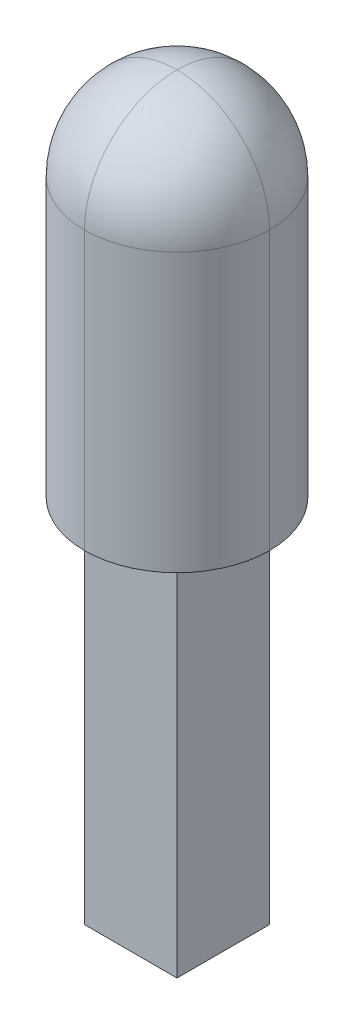
ISO-10303-21;
HEADER;
FILE_DESCRIPTION(('STEP AP214'),'2;1');
FILE_NAME('part.step','',(''),(''),'','','');
FILE_SCHEMA(('AUTOMOTIVE_DESIGN { 1 0 10303 214 1 1 1 1 }'));
ENDSEC;
DATA;
#1=APPLICATION_CONTEXT('core data for automotive mechanical design processes');
#2=APPLICATION_PROTOCOL_DEFINITION('international standard','automotive_design',2000,#1);
#3=PRODUCT_CONTEXT('',#1,'mechanical');
#4=PRODUCT('Part','Part','',(#3));
#5=PRODUCT_RELATED_PRODUCT_CATEGORY('part','',(#4));
#6=PRODUCT_DEFINITION_FORMATION('','',#4);
#7=PRODUCT_DEFINITION_CONTEXT('part definition',#1,'design');
#8=PRODUCT_DEFINITION('design','',#6,#7);
#9=PRODUCT_DEFINITION_SHAPE('','',#8);
#10=(LENGTH_UNIT() NAMED_UNIT(*) SI_UNIT(.MILLI.,.METRE.));
#11=(NAMED_UNIT(*) PLANE_ANGLE_UNIT() SI_UNIT($,.RADIAN.));
#12=(NAMED_UNIT(*) SI_UNIT($,.STERADIAN.) SOLID_ANGLE_UNIT());
#13=UNCERTAINTY_MEASURE_WITH_UNIT(LENGTH_MEASURE(1.E-05),#10,'distance_accuracy_value','');
#14=(GEOMETRIC_REPRESENTATION_CONTEXT(3) GLOBAL_UNCERTAINTY_ASSIGNED_CONTEXT((#13)) GLOBAL_UNIT_ASSIGNED_CONTEXT((#10,
#11,#12)) REPRESENTATION_CONTEXT('',''));
#15=CARTESIAN_POINT('',(0.,0.,0.));
#16=DIRECTION('',(0.,0.,1.));
#17=DIRECTION('',(1.,0.,0.));
#18=AXIS2_PLACEMENT_3D('',#15,#16,#17);
#19=CARTESIAN_POINT('',(0.,0.,0.));
#20=DIRECTION('',(0.,1.,0.));
#21=DIRECTION('',(0.,0.,1.));
#22=AXIS2_PLACEMENT_3D('',#19,#20,#21);
#23=PLANE('',#22);
#24=CARTESIAN_POINT('',(0.,0.,0.));
#25=DIRECTION('',(0.,1.,0.));
#26=DIRECTION('',(0.,0.,1.));
#27=AXIS2_PLACEMENT_3D('',#24,#25,#26);
#28=CIRCLE('',#27,25.);
#29=CARTESIAN_POINT('',(0.,0.,25.));
#30=VERTEX_POINT('',#29);
#31=CARTESIAN_POINT('',(-25.,0.,0.));
#32=VERTEX_POINT('',#31);
#33=EDGE_CURVE('E127',#30,#32,#28,.F.);
#34=ORIENTED_EDGE('',*,*,#33,.T.);
#35=CARTESIAN_POINT('',(0.,0.,0.));
#36=DIRECTION('',(0.,1.,0.));
#37=DIRECTION('',(0.,0.,1.));
#38=AXIS2_PLACEMENT_3D('',#35,#36,#37);
#39=CIRCLE('',#38,25.);
#40=CARTESIAN_POINT('',(0.,0.,-25.));
#41=VERTEX_POINT('',#40);
#42=EDGE_CURVE('E139',#32,#41,#39,.F.);
#43=ORIENTED_EDGE('',*,*,#42,.T.);
#44=CARTESIAN_POINT('',(0.,0.,0.));
#45=DIRECTION('',(0.,1.,0.));
#46=DIRECTION('',(0.,0.,1.));
#47=AXIS2_PLACEMENT_3D('',#44,#45,#46);
#48=CIRCLE('',#47,25.);
#49=CARTESIAN_POINT('',(25.,0.,0.));
#50=VERTEX_POINT('',#49);
#51=EDGE_CURVE('E136',#41,#50,#48,.F.);
#52=ORIENTED_EDGE('',*,*,#51,.T.);
#53=CARTESIAN_POINT('',(0.,0.,0.));
#54=DIRECTION('',(0.,1.,0.));
#55=DIRECTION('',(0.,0.,1.));
#56=AXIS2_PLACEMENT_3D('',#53,#54,#55);
#57=CIRCLE('',#56,25.);
#58=EDGE_CURVE('E129',#50,#30,#57,.F.);
#59=ORIENTED_EDGE('',*,*,#58,.T.);
#60=EDGE_LOOP('',(#34,#43,#52,#59));
#61=FACE_BOUND('',#60,.T.);
#62=DIRECTION('',(0.,0.,1.));
#63=VECTOR('',#62,1.);
#64=CARTESIAN_POINT('',(12.5,0.,12.5));
#65=LINE('',#64,#63);
#66=CARTESIAN_POINT('',(12.5,0.,-12.5));
#67=VERTEX_POINT('',#66);
#68=CARTESIAN_POINT('',(12.5,0.,12.5));
#69=VERTEX_POINT('',#68);
#70=EDGE_CURVE('E126',#67,#69,#65,.T.);
#71=ORIENTED_EDGE('',*,*,#70,.F.);
#72=DIRECTION('',(1.,0.,0.));
#73=VECTOR('',#72,1.);
#74=CARTESIAN_POINT('',(-12.5,0.,-12.5));
#75=LINE('',#74,#73);
#76=CARTESIAN_POINT('',(-12.5,0.,-12.5));
#77=VERTEX_POINT('',#76);
#78=EDGE_CURVE('E123',#77,#67,#75,.T.);
#79=ORIENTED_EDGE('',*,*,#78,.F.);
#80=DIRECTION('',(0.,0.,-1.));
#81=VECTOR('',#80,1.);
#82=CARTESIAN_POINT('',(-12.5,0.,12.5));
#83=LINE('',#82,#81);
#84=CARTESIAN_POINT('',(-12.5,0.,12.5));
#85=VERTEX_POINT('',#84);
#86=EDGE_CURVE('E315',#85,#77,#83,.T.);
#87=ORIENTED_EDGE('',*,*,#86,.F.);
#88=DIRECTION('',(-1.,0.,0.));
#89=VECTOR('',#88,1.);
#90=CARTESIAN_POINT('',(-12.5,0.,12.5));
#91=LINE('',#90,#89);
#92=EDGE_CURVE('E317',#69,#85,#91,.T.);
#93=ORIENTED_EDGE('',*,*,#92,.F.);
#94=EDGE_LOOP('',(#71,#79,#87,#93));
#95=FACE_BOUND('',#94,.T.);
#96=ADVANCED_FACE('F38',(#61,#95),#23,.F.);
#97=CARTESIAN_POINT('',(12.5,-100.,12.5));
#98=DIRECTION('',(-1.,0.,0.));
#99=DIRECTION('',(0.,0.,1.));
#100=AXIS2_PLACEMENT_3D('',#97,#98,#99);
#101=PLANE('',#100);
#102=ORIENTED_EDGE('',*,*,#70,.T.);
#103=DIRECTION('',(0.,1.,0.));
#104=VECTOR('',#103,1.);
#105=CARTESIAN_POINT('',(12.5,-100.,12.5));
#106=LINE('',#105,#104);
#107=CARTESIAN_POINT('',(12.5,-100.,12.5));
#108=VERTEX_POINT('',#107);
#109=EDGE_CURVE('E107',#108,#69,#106,.T.);
#110=ORIENTED_EDGE('',*,*,#109,.F.);
#111=DIRECTION('',(0.,0.,1.));
#112=VECTOR('',#111,1.);
#113=CARTESIAN_POINT('',(12.5,-100.,12.5));
#114=LINE('',#113,#112);
#115=CARTESIAN_POINT('',(12.5,-100.,-12.5));
#116=VERTEX_POINT('',#115);
#117=EDGE_CURVE('E114',#116,#108,#114,.T.);
#118=ORIENTED_EDGE('',*,*,#117,.F.);
#119=DIRECTION('',(0.,1.,0.));
#120=VECTOR('',#119,1.);
#121=CARTESIAN_POINT('',(12.5,-100.,-12.5));
#122=LINE('',#121,#120);
#123=EDGE_CURVE('E320',#116,#67,#122,.T.);
#124=ORIENTED_EDGE('',*,*,#123,.T.);
#125=EDGE_LOOP('',(#102,#110,#118,#124));
#126=FACE_BOUND('',#125,.T.);
#127=ADVANCED_FACE('F125',(#126),#101,.F.);
#128=CARTESIAN_POINT('',(-12.5,-100.,12.5));
#129=DIRECTION('',(0.,0.,-1.));
#130=DIRECTION('',(-1.,0.,0.));
#131=AXIS2_PLACEMENT_3D('',#128,#129,#130);
#132=PLANE('',#131);
#133=ORIENTED_EDGE('',*,*,#92,.T.);
#134=DIRECTION('',(0.,1.,0.));
#135=VECTOR('',#134,1.);
#136=CARTESIAN_POINT('',(-12.5,-100.,12.5));
#137=LINE('',#136,#135);
#138=CARTESIAN_POINT('',(-12.5,-100.,12.5));
#139=VERTEX_POINT('',#138);
#140=EDGE_CURVE('E110',#139,#85,#137,.T.);
#141=ORIENTED_EDGE('',*,*,#140,.F.);
#142=DIRECTION('',(-1.,0.,0.));
#143=VECTOR('',#142,1.);
#144=CARTESIAN_POINT('',(-12.5,-100.,12.5));
#145=LINE('',#144,#143);
#146=EDGE_CURVE('E102',#108,#139,#145,.T.);
#147=ORIENTED_EDGE('',*,*,#146,.F.);
#148=ORIENTED_EDGE('',*,*,#109,.T.);
#149=EDGE_LOOP('',(#133,#141,#147,#148));
#150=FACE_BOUND('',#149,.T.);
#151=ADVANCED_FACE('F105',(#150),#132,.F.);
#152=CARTESIAN_POINT('',(-12.5,-100.,12.5));
#153=DIRECTION('',(1.,0.,0.));
#154=DIRECTION('',(0.,0.,-1.));
#155=AXIS2_PLACEMENT_3D('',#152,#153,#154);
#156=PLANE('',#155);
#157=ORIENTED_EDGE('',*,*,#86,.T.);
#158=DIRECTION('',(0.,1.,0.));
#159=VECTOR('',#158,1.);
#160=CARTESIAN_POINT('',(-12.5,-100.,-12.5));
#161=LINE('',#160,#159);
#162=CARTESIAN_POINT('',(-12.5,-100.,-12.5));
#163=VERTEX_POINT('',#162);
#164=EDGE_CURVE('E131',#163,#77,#161,.T.);
#165=ORIENTED_EDGE('',*,*,#164,.F.);
#166=DIRECTION('',(0.,0.,-1.));
#167=VECTOR('',#166,1.);
#168=CARTESIAN_POINT('',(-12.5,-100.,12.5));
#169=LINE('',#168,#167);
#170=EDGE_CURVE('E113',#139,#163,#169,.T.);
#171=ORIENTED_EDGE('',*,*,#170,.F.);
#172=ORIENTED_EDGE('',*,*,#140,.T.);
#173=EDGE_LOOP('',(#157,#165,#171,#172));
#174=FACE_BOUND('',#173,.T.);
#175=ADVANCED_FACE('F220',(#174),#156,.F.);
#176=CARTESIAN_POINT('',(-12.5,-100.,-12.5));
#177=DIRECTION('',(0.,0.,1.));
#178=DIRECTION('',(1.,0.,0.));
#179=AXIS2_PLACEMENT_3D('',#176,#177,#178);
#180=PLANE('',#179);
#181=ORIENTED_EDGE('',*,*,#78,.T.);
#182=ORIENTED_EDGE('',*,*,#123,.F.);
#183=DIRECTION('',(1.,0.,0.));
#184=VECTOR('',#183,1.);
#185=CARTESIAN_POINT('',(-12.5,-100.,-12.5));
#186=LINE('',#185,#184);
#187=EDGE_CURVE('E119',#163,#116,#186,.T.);
#188=ORIENTED_EDGE('',*,*,#187,.F.);
#189=ORIENTED_EDGE('',*,*,#164,.T.);
#190=EDGE_LOOP('',(#181,#182,#188,#189));
#191=FACE_BOUND('',#190,.T.);
#192=ADVANCED_FACE('F215',(#191),#180,.F.);
#193=CARTESIAN_POINT('',(0.,-100.,0.));
#194=DIRECTION('',(0.,-1.,0.));
#195=DIRECTION('',(0.,0.,-1.));
#196=AXIS2_PLACEMENT_3D('',#193,#194,#195);
#197=PLANE('',#196);
#198=ORIENTED_EDGE('',*,*,#117,.T.);
#199=ORIENTED_EDGE('',*,*,#146,.T.);
#200=ORIENTED_EDGE('',*,*,#170,.T.);
#201=ORIENTED_EDGE('',*,*,#187,.T.);
#202=EDGE_LOOP('',(#198,#199,#200,#201));
#203=FACE_BOUND('',#202,.T.);
#204=ADVANCED_FACE('F117',(#203),#197,.T.);
#205=CARTESIAN_POINT('',(0.,100.,0.));
#206=DIRECTION('',(0.,-1.,0.));
#207=DIRECTION('',(0.,0.,-1.));
#208=AXIS2_PLACEMENT_3D('',#205,#206,#207);
#209=CYLINDRICAL_SURFACE('',#208,25.);
#210=DIRECTION('',(0.,-1.,0.));
#211=VECTOR('',#210,1.);
#212=CARTESIAN_POINT('',(25.,100.,0.));
#213=LINE('',#212,#211);
#214=CARTESIAN_POINT('',(25.,75.,0.));
#215=VERTEX_POINT('',#214);
#216=EDGE_CURVE('E150',#215,#50,#213,.T.);
#217=ORIENTED_EDGE('',*,*,#216,.F.);
#218=CARTESIAN_POINT('',(0.,75.,0.));
#219=DIRECTION('',(0.,-1.,0.));
#220=DIRECTION('',(0.,0.,-1.));
#221=AXIS2_PLACEMENT_3D('',#218,#219,#220);
#222=CIRCLE('',#221,25.);
#223=CARTESIAN_POINT('',(0.,75.,25.));
#224=VERTEX_POINT('',#223);
#225=EDGE_CURVE('E142',#215,#224,#222,.T.);
#226=ORIENTED_EDGE('',*,*,#225,.T.);
#227=DIRECTION('',(0.,-1.,0.));
#228=VECTOR('',#227,1.);
#229=CARTESIAN_POINT('',(0.,100.,25.));
#230=LINE('',#229,#228);
#231=EDGE_CURVE('E147',#30,#224,#230,.F.);
#232=ORIENTED_EDGE('',*,*,#231,.F.);
#233=ORIENTED_EDGE('',*,*,#58,.F.);
#234=EDGE_LOOP('',(#217,#226,#232,#233));
#235=FACE_BOUND('',#234,.T.);
#236=ADVANCED_FACE('F182',(#235),#209,.T.);
#237=CARTESIAN_POINT('',(0.,100.,0.));
#238=DIRECTION('',(0.,-1.,0.));
#239=DIRECTION('',(0.,0.,-1.));
#240=AXIS2_PLACEMENT_3D('',#237,#238,#239);
#241=CYLINDRICAL_SURFACE('',#240,25.);
#242=DIRECTION('',(0.,-1.,0.));
#243=VECTOR('',#242,1.);
#244=CARTESIAN_POINT('',(0.,100.,-25.));
#245=LINE('',#244,#243);
#246=CARTESIAN_POINT('',(0.,75.,-25.));
#247=VERTEX_POINT('',#246);
#248=EDGE_CURVE('E145',#247,#41,#245,.T.);
#249=ORIENTED_EDGE('',*,*,#248,.F.);
#250=CARTESIAN_POINT('',(0.,75.,0.));
#251=DIRECTION('',(0.,-1.,0.));
#252=DIRECTION('',(0.,0.,-1.));
#253=AXIS2_PLACEMENT_3D('',#250,#251,#252);
#254=CIRCLE('',#253,25.);
#255=EDGE_CURVE('E11',#247,#215,#254,.T.);
#256=ORIENTED_EDGE('',*,*,#255,.T.);
#257=ORIENTED_EDGE('',*,*,#216,.T.);
#258=ORIENTED_EDGE('',*,*,#51,.F.);
#259=EDGE_LOOP('',(#249,#256,#257,#258));
#260=FACE_BOUND('',#259,.T.);
#261=ADVANCED_FACE('F177',(#260),#241,.T.);
#262=CARTESIAN_POINT('',(0.,100.,0.));
#263=DIRECTION('',(0.,-1.,0.));
#264=DIRECTION('',(0.,0.,-1.));
#265=AXIS2_PLACEMENT_3D('',#262,#263,#264);
#266=CYLINDRICAL_SURFACE('',#265,25.);
#267=ORIENTED_EDGE('',*,*,#231,.T.);
#268=CARTESIAN_POINT('',(0.,75.,0.));
#269=DIRECTION('',(0.,-1.,0.));
#270=DIRECTION('',(0.,0.,-1.));
#271=AXIS2_PLACEMENT_3D('',#268,#269,#270);
#272=CIRCLE('',#271,25.);
#273=CARTESIAN_POINT('',(-25.,75.,0.));
#274=VERTEX_POINT('',#273);
#275=EDGE_CURVE('E154',#224,#274,#272,.T.);
#276=ORIENTED_EDGE('',*,*,#275,.T.);
#277=DIRECTION('',(0.,-1.,0.));
#278=VECTOR('',#277,1.);
#279=CARTESIAN_POINT('',(-25.,100.,0.));
#280=LINE('',#279,#278);
#281=EDGE_CURVE('E143',#32,#274,#280,.F.);
#282=ORIENTED_EDGE('',*,*,#281,.F.);
#283=ORIENTED_EDGE('',*,*,#33,.F.);
#284=EDGE_LOOP('',(#267,#276,#282,#283));
#285=FACE_BOUND('',#284,.T.);
#286=ADVANCED_FACE('F206',(#285),#266,.T.);
#287=CARTESIAN_POINT('',(0.,100.,0.));
#288=DIRECTION('',(0.,-1.,0.));
#289=DIRECTION('',(0.,0.,-1.));
#290=AXIS2_PLACEMENT_3D('',#287,#288,#289);
#291=CYLINDRICAL_SURFACE('',#290,25.);
#292=ORIENTED_EDGE('',*,*,#281,.T.);
#293=CARTESIAN_POINT('',(0.,75.,0.));
#294=DIRECTION('',(0.,-1.,0.));
#295=DIRECTION('',(0.,0.,-1.));
#296=AXIS2_PLACEMENT_3D('',#293,#294,#295);
#297=CIRCLE('',#296,25.);
#298=EDGE_CURVE('E48',#274,#247,#297,.T.);
#299=ORIENTED_EDGE('',*,*,#298,.T.);
#300=ORIENTED_EDGE('',*,*,#248,.T.);
#301=ORIENTED_EDGE('',*,*,#42,.F.);
#302=EDGE_LOOP('',(#292,#299,#300,#301));
#303=FACE_BOUND('',#302,.T.);
#304=ADVANCED_FACE('F203',(#303),#291,.T.);
#305=CARTESIAN_POINT('',(0.,75.,0.));
#306=DIRECTION('',(0.,1.,0.));
#307=DIRECTION('',(0.,0.,1.));
#308=AXIS2_PLACEMENT_3D('',#305,#306,#307);
#309=SPHERICAL_SURFACE('',#308,25.);
#310=CARTESIAN_POINT('',(0.,75.,0.));
#311=DIRECTION('',(1.,0.,0.));
#312=DIRECTION('',(0.,0.,-1.));
#313=AXIS2_PLACEMENT_3D('',#310,#311,#312);
#314=CIRCLE('',#313,25.);
#315=CARTESIAN_POINT('',(0.,100.,0.));
#316=VERTEX_POINT('',#315);
#317=EDGE_CURVE('E161',#247,#316,#314,.T.);
#318=ORIENTED_EDGE('',*,*,#317,.F.);
#319=ORIENTED_EDGE('',*,*,#298,.F.);
#320=CARTESIAN_POINT('',(0.,75.,0.));
#321=DIRECTION('',(0.,0.,1.));
#322=DIRECTION('',(1.,0.,0.));
#323=AXIS2_PLACEMENT_3D('',#320,#321,#322);
#324=CIRCLE('',#323,25.);
#325=EDGE_CURVE('E42',#316,#274,#324,.T.);
#326=ORIENTED_EDGE('',*,*,#325,.F.);
#327=EDGE_LOOP('',(#318,#319,#326));
#328=FACE_BOUND('',#327,.T.);
#329=ADVANCED_FACE('F40',(#328),#309,.T.);
#330=CARTESIAN_POINT('',(0.,75.,0.));
#331=DIRECTION('',(0.,1.,0.));
#332=DIRECTION('',(0.,0.,1.));
#333=AXIS2_PLACEMENT_3D('',#330,#331,#332);
#334=SPHERICAL_SURFACE('',#333,25.);
#335=ORIENTED_EDGE('',*,*,#325,.T.);
#336=ORIENTED_EDGE('',*,*,#275,.F.);
#337=CARTESIAN_POINT('',(0.,75.,0.));
#338=DIRECTION('',(1.,0.,0.));
#339=DIRECTION('',(0.,0.,-1.));
#340=AXIS2_PLACEMENT_3D('',#337,#338,#339);
#341=CIRCLE('',#340,25.);
#342=EDGE_CURVE('E160',#316,#224,#341,.T.);
#343=ORIENTED_EDGE('',*,*,#342,.F.);
#344=EDGE_LOOP('',(#335,#336,#343));
#345=FACE_BOUND('',#344,.T.);
#346=ADVANCED_FACE('F172',(#345),#334,.T.);
#347=CARTESIAN_POINT('',(0.,75.,0.));
#348=DIRECTION('',(0.,1.,0.));
#349=DIRECTION('',(0.,0.,1.));
#350=AXIS2_PLACEMENT_3D('',#347,#348,#349);
#351=SPHERICAL_SURFACE('',#350,25.);
#352=ORIENTED_EDGE('',*,*,#255,.F.);
#353=ORIENTED_EDGE('',*,*,#317,.T.);
#354=CARTESIAN_POINT('',(0.,75.,0.));
#355=DIRECTION('',(0.,0.,1.));
#356=DIRECTION('',(1.,0.,0.));
#357=AXIS2_PLACEMENT_3D('',#354,#355,#356);
#358=CIRCLE('',#357,25.);
#359=EDGE_CURVE('E157',#215,#316,#358,.T.);
#360=ORIENTED_EDGE('',*,*,#359,.F.);
#361=EDGE_LOOP('',(#352,#353,#360));
#362=FACE_BOUND('',#361,.T.);
#363=ADVANCED_FACE('F174',(#362),#351,.T.);
#364=CARTESIAN_POINT('',(0.,75.,0.));
#365=DIRECTION('',(0.,1.,0.));
#366=DIRECTION('',(0.,0.,1.));
#367=AXIS2_PLACEMENT_3D('',#364,#365,#366);
#368=SPHERICAL_SURFACE('',#367,25.);
#369=ORIENTED_EDGE('',*,*,#342,.T.);
#370=ORIENTED_EDGE('',*,*,#225,.F.);
#371=ORIENTED_EDGE('',*,*,#359,.T.);
#372=EDGE_LOOP('',(#369,#370,#371));
#373=FACE_BOUND('',#372,.T.);
#374=ADVANCED_FACE('F185',(#373),#368,.T.);
#375=CLOSED_SHELL('',(#96,#127,#151,#175,#192,#204,#236,#261,#286,#304,#329,#346,#363,#374));
#376=MANIFOLD_SOLID_BREP('B2',#375);
#377=ADVANCED_BREP_SHAPE_REPRESENTATION('',(#18,#376),#14);
#378=SHAPE_DEFINITION_REPRESENTATION(#9,#377);
ENDSEC;
END-ISO-10303-21;
